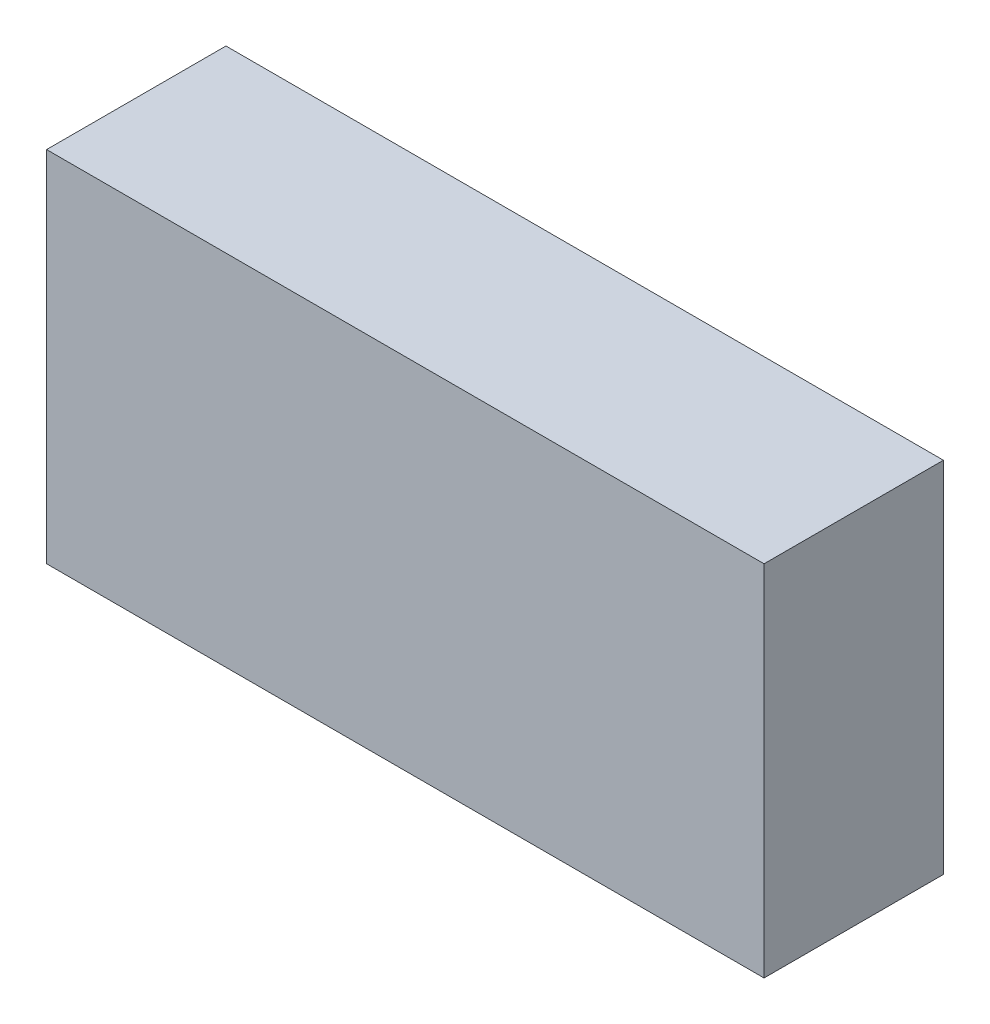
ISO-10303-21;
HEADER;
FILE_DESCRIPTION(('STEP AP214'),'2;1');
FILE_NAME('part.step','',(''),(''),'','','');
FILE_SCHEMA(('AUTOMOTIVE_DESIGN { 1 0 10303 214 1 1 1 1 }'));
ENDSEC;
DATA;
#1=APPLICATION_CONTEXT('core data for automotive mechanical design processes');
#2=APPLICATION_PROTOCOL_DEFINITION('international standard','automotive_design',2000,#1);
#3=PRODUCT_CONTEXT('',#1,'mechanical');
#4=PRODUCT('Part','Part','',(#3));
#5=PRODUCT_RELATED_PRODUCT_CATEGORY('part','',(#4));
#6=PRODUCT_DEFINITION_FORMATION('','',#4);
#7=PRODUCT_DEFINITION_CONTEXT('part definition',#1,'design');
#8=PRODUCT_DEFINITION('design','',#6,#7);
#9=PRODUCT_DEFINITION_SHAPE('','',#8);
#10=(LENGTH_UNIT() NAMED_UNIT(*) SI_UNIT(.MILLI.,.METRE.));
#11=(NAMED_UNIT(*) PLANE_ANGLE_UNIT() SI_UNIT($,.RADIAN.));
#12=(NAMED_UNIT(*) SI_UNIT($,.STERADIAN.) SOLID_ANGLE_UNIT());
#13=UNCERTAINTY_MEASURE_WITH_UNIT(LENGTH_MEASURE(1.E-05),#10,'distance_accuracy_value','');
#14=(GEOMETRIC_REPRESENTATION_CONTEXT(3) GLOBAL_UNCERTAINTY_ASSIGNED_CONTEXT((#13)) GLOBAL_UNIT_ASSIGNED_CONTEXT((#10,
#11,#12)) REPRESENTATION_CONTEXT('',''));
#15=CARTESIAN_POINT('',(0.,0.,0.));
#16=DIRECTION('',(0.,0.,1.));
#17=DIRECTION('',(1.,0.,0.));
#18=AXIS2_PLACEMENT_3D('',#15,#16,#17);
#19=CARTESIAN_POINT('',(0.80000094,-0.3999992,0.));
#20=DIRECTION('',(-1.,0.,0.));
#21=DIRECTION('',(0.,0.,1.));
#22=AXIS2_PLACEMENT_3D('',#19,#20,#21);
#23=PLANE('',#22);
#24=DIRECTION('',(0.,1.,0.));
#25=VECTOR('',#24,1.);
#26=CARTESIAN_POINT('',(0.80000094,-0.3999992,0.));
#27=LINE('',#26,#25);
#28=CARTESIAN_POINT('',(0.80000094,-0.3999992,0.));
#29=VERTEX_POINT('',#28);
#30=CARTESIAN_POINT('',(0.80000094,0.3999992,0.));
#31=VERTEX_POINT('',#30);
#32=EDGE_CURVE('E11',#29,#31,#27,.T.);
#33=ORIENTED_EDGE('',*,*,#32,.T.);
#34=DIRECTION('',(0.,0.,1.));
#35=VECTOR('',#34,1.);
#36=CARTESIAN_POINT('',(0.80000094,0.3999992,0.));
#37=LINE('',#36,#35);
#38=CARTESIAN_POINT('',(0.80000094,0.3999992,0.3999992));
#39=VERTEX_POINT('',#38);
#40=EDGE_CURVE('E27',#31,#39,#37,.T.);
#41=ORIENTED_EDGE('',*,*,#40,.T.);
#42=DIRECTION('',(0.,1.,0.));
#43=VECTOR('',#42,1.);
#44=CARTESIAN_POINT('',(0.80000094,-0.3999992,0.3999992));
#45=LINE('',#44,#43);
#46=CARTESIAN_POINT('',(0.80000094,-0.3999992,0.3999992));
#47=VERTEX_POINT('',#46);
#48=EDGE_CURVE('E66',#47,#39,#45,.T.);
#49=ORIENTED_EDGE('',*,*,#48,.F.);
#50=DIRECTION('',(0.,0.,1.));
#51=VECTOR('',#50,1.);
#52=CARTESIAN_POINT('',(0.80000094,-0.3999992,0.));
#53=LINE('',#52,#51);
#54=EDGE_CURVE('E70',#29,#47,#53,.T.);
#55=ORIENTED_EDGE('',*,*,#54,.F.);
#56=EDGE_LOOP('',(#33,#41,#49,#55));
#57=FACE_BOUND('',#56,.T.);
#58=ADVANCED_FACE('F16',(#57),#23,.F.);
#59=CARTESIAN_POINT('',(0.80000094,0.3999992,0.));
#60=DIRECTION('',(0.,-1.,0.));
#61=DIRECTION('',(0.,0.,-1.));
#62=AXIS2_PLACEMENT_3D('',#59,#60,#61);
#63=PLANE('',#62);
#64=DIRECTION('',(-1.,0.,0.));
#65=VECTOR('',#64,1.);
#66=CARTESIAN_POINT('',(0.80000094,0.3999992,0.));
#67=LINE('',#66,#65);
#68=CARTESIAN_POINT('',(-0.80000094,0.3999992,0.));
#69=VERTEX_POINT('',#68);
#70=EDGE_CURVE('E83',#31,#69,#67,.T.);
#71=ORIENTED_EDGE('',*,*,#70,.T.);
#72=DIRECTION('',(0.,0.,1.));
#73=VECTOR('',#72,1.);
#74=CARTESIAN_POINT('',(-0.80000094,0.3999992,0.));
#75=LINE('',#74,#73);
#76=CARTESIAN_POINT('',(-0.80000094,0.3999992,0.3999992));
#77=VERTEX_POINT('',#76);
#78=EDGE_CURVE('E98',#69,#77,#75,.T.);
#79=ORIENTED_EDGE('',*,*,#78,.T.);
#80=DIRECTION('',(-1.,0.,0.));
#81=VECTOR('',#80,1.);
#82=CARTESIAN_POINT('',(0.80000094,0.3999992,0.3999992));
#83=LINE('',#82,#81);
#84=EDGE_CURVE('E20',#39,#77,#83,.T.);
#85=ORIENTED_EDGE('',*,*,#84,.F.);
#86=ORIENTED_EDGE('',*,*,#40,.F.);
#87=EDGE_LOOP('',(#71,#79,#85,#86));
#88=FACE_BOUND('',#87,.T.);
#89=ADVANCED_FACE('F118',(#88),#63,.F.);
#90=CARTESIAN_POINT('',(-0.80000094,0.3999992,0.));
#91=DIRECTION('',(1.,0.,0.));
#92=DIRECTION('',(0.,1.,0.));
#93=AXIS2_PLACEMENT_3D('',#90,#91,#92);
#94=PLANE('',#93);
#95=DIRECTION('',(0.,-1.,0.));
#96=VECTOR('',#95,1.);
#97=CARTESIAN_POINT('',(-0.80000094,0.3999992,0.));
#98=LINE('',#97,#96);
#99=CARTESIAN_POINT('',(-0.80000094,-0.3999992,0.));
#100=VERTEX_POINT('',#99);
#101=EDGE_CURVE('E94',#69,#100,#98,.T.);
#102=ORIENTED_EDGE('',*,*,#101,.T.);
#103=DIRECTION('',(0.,0.,1.));
#104=VECTOR('',#103,1.);
#105=CARTESIAN_POINT('',(-0.80000094,-0.3999992,0.));
#106=LINE('',#105,#104);
#107=CARTESIAN_POINT('',(-0.80000094,-0.3999992,0.3999992));
#108=VERTEX_POINT('',#107);
#109=EDGE_CURVE('E86',#100,#108,#106,.T.);
#110=ORIENTED_EDGE('',*,*,#109,.T.);
#111=DIRECTION('',(0.,-1.,0.));
#112=VECTOR('',#111,1.);
#113=CARTESIAN_POINT('',(-0.80000094,0.3999992,0.3999992));
#114=LINE('',#113,#112);
#115=EDGE_CURVE('E108',#77,#108,#114,.T.);
#116=ORIENTED_EDGE('',*,*,#115,.F.);
#117=ORIENTED_EDGE('',*,*,#78,.F.);
#118=EDGE_LOOP('',(#102,#110,#116,#117));
#119=FACE_BOUND('',#118,.T.);
#120=ADVANCED_FACE('F120',(#119),#94,.F.);
#121=CARTESIAN_POINT('',(-0.80000094,-0.3999992,0.));
#122=DIRECTION('',(0.,1.,0.));
#123=DIRECTION('',(1.,0.,0.));
#124=AXIS2_PLACEMENT_3D('',#121,#122,#123);
#125=PLANE('',#124);
#126=DIRECTION('',(1.,0.,0.));
#127=VECTOR('',#126,1.);
#128=CARTESIAN_POINT('',(-0.80000094,-0.3999992,0.));
#129=LINE('',#128,#127);
#130=EDGE_CURVE('E78',#100,#29,#129,.T.);
#131=ORIENTED_EDGE('',*,*,#130,.T.);
#132=ORIENTED_EDGE('',*,*,#54,.T.);
#133=DIRECTION('',(1.,0.,0.));
#134=VECTOR('',#133,1.);
#135=CARTESIAN_POINT('',(-0.80000094,-0.3999992,0.3999992));
#136=LINE('',#135,#134);
#137=EDGE_CURVE('E106',#108,#47,#136,.T.);
#138=ORIENTED_EDGE('',*,*,#137,.F.);
#139=ORIENTED_EDGE('',*,*,#109,.F.);
#140=EDGE_LOOP('',(#131,#132,#138,#139));
#141=FACE_BOUND('',#140,.T.);
#142=ADVANCED_FACE('F84',(#141),#125,.F.);
#143=CARTESIAN_POINT('',(0.80000094,-0.3999992,0.));
#144=DIRECTION('',(0.,0.,-1.));
#145=DIRECTION('',(0.,-1.,0.));
#146=AXIS2_PLACEMENT_3D('',#143,#144,#145);
#147=PLANE('',#146);
#148=ORIENTED_EDGE('',*,*,#130,.F.);
#149=ORIENTED_EDGE('',*,*,#101,.F.);
#150=ORIENTED_EDGE('',*,*,#70,.F.);
#151=ORIENTED_EDGE('',*,*,#32,.F.);
#152=EDGE_LOOP('',(#148,#149,#150,#151));
#153=FACE_BOUND('',#152,.T.);
#154=ADVANCED_FACE('F18',(#153),#147,.T.);
#155=CARTESIAN_POINT('',(0.80000094,-0.3999992,0.3999992));
#156=DIRECTION('',(0.,0.,-1.));
#157=DIRECTION('',(0.,-1.,0.));
#158=AXIS2_PLACEMENT_3D('',#155,#156,#157);
#159=PLANE('',#158);
#160=ORIENTED_EDGE('',*,*,#48,.T.);
#161=ORIENTED_EDGE('',*,*,#84,.T.);
#162=ORIENTED_EDGE('',*,*,#115,.T.);
#163=ORIENTED_EDGE('',*,*,#137,.T.);
#164=EDGE_LOOP('',(#160,#161,#162,#163));
#165=FACE_BOUND('',#164,.T.);
#166=ADVANCED_FACE('F117',(#165),#159,.F.);
#167=CLOSED_SHELL('',(#58,#89,#120,#142,#154,#166));
#168=MANIFOLD_SOLID_BREP('B1',#167);
#169=ADVANCED_BREP_SHAPE_REPRESENTATION('',(#18,#168),#14);
#170=SHAPE_DEFINITION_REPRESENTATION(#9,#169);
ENDSEC;
END-ISO-10303-21;
